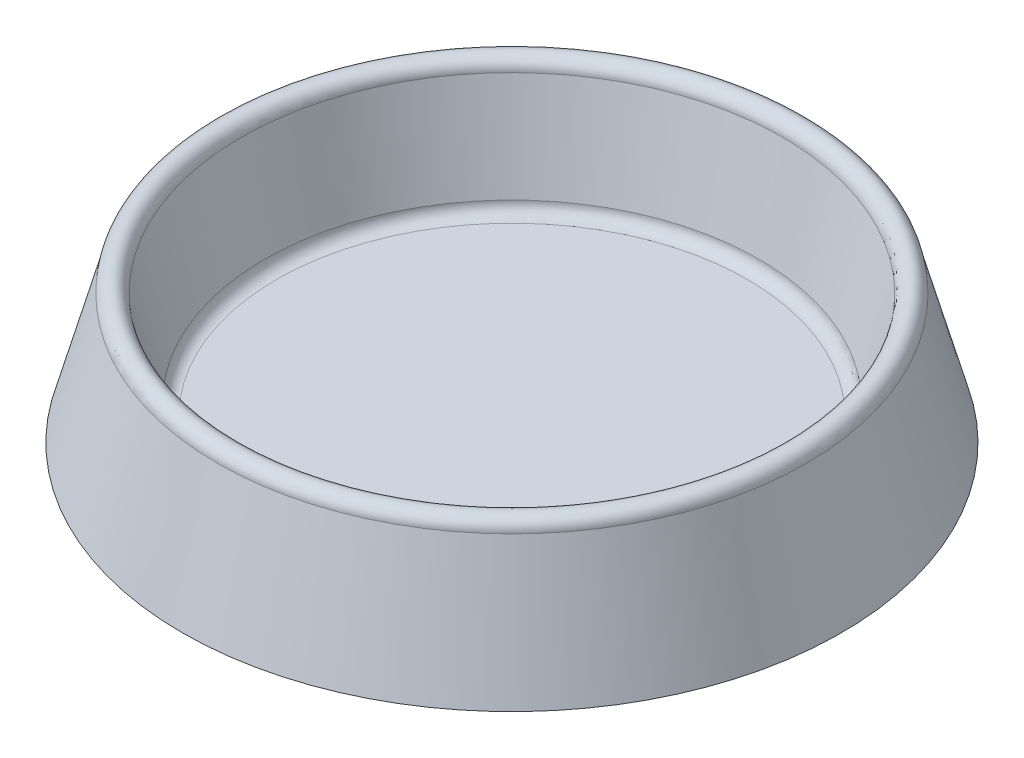
ISO-10303-21;
HEADER;
FILE_DESCRIPTION(('STEP AP214'),'2;1');
FILE_NAME('part.step','',(''),(''),'','','');
FILE_SCHEMA(('AUTOMOTIVE_DESIGN { 1 0 10303 214 1 1 1 1 }'));
ENDSEC;
DATA;
#1=APPLICATION_CONTEXT('core data for automotive mechanical design processes');
#2=APPLICATION_PROTOCOL_DEFINITION('international standard','automotive_design',2000,#1);
#3=PRODUCT_CONTEXT('',#1,'mechanical');
#4=PRODUCT('Part','Part','',(#3));
#5=PRODUCT_RELATED_PRODUCT_CATEGORY('part','',(#4));
#6=PRODUCT_DEFINITION_FORMATION('','',#4);
#7=PRODUCT_DEFINITION_CONTEXT('part definition',#1,'design');
#8=PRODUCT_DEFINITION('design','',#6,#7);
#9=PRODUCT_DEFINITION_SHAPE('','',#8);
#10=(LENGTH_UNIT() NAMED_UNIT(*) SI_UNIT(.MILLI.,.METRE.));
#11=(NAMED_UNIT(*) PLANE_ANGLE_UNIT() SI_UNIT($,.RADIAN.));
#12=(NAMED_UNIT(*) SI_UNIT($,.STERADIAN.) SOLID_ANGLE_UNIT());
#13=UNCERTAINTY_MEASURE_WITH_UNIT(LENGTH_MEASURE(1.E-05),#10,'distance_accuracy_value','');
#14=(GEOMETRIC_REPRESENTATION_CONTEXT(3) GLOBAL_UNCERTAINTY_ASSIGNED_CONTEXT((#13)) GLOBAL_UNIT_ASSIGNED_CONTEXT((#10,
#11,#12)) REPRESENTATION_CONTEXT('',''));
#15=CARTESIAN_POINT('',(0.,0.,0.));
#16=DIRECTION('',(0.,0.,1.));
#17=DIRECTION('',(1.,0.,0.));
#18=AXIS2_PLACEMENT_3D('',#15,#16,#17);
#19=CARTESIAN_POINT('',(-50.,9.36893203883496,0.));
#20=DIRECTION('',(0.,1.,0.));
#21=DIRECTION('',(0.,0.,1.));
#22=AXIS2_PLACEMENT_3D('',#19,#20,#21);
#23=PLANE('',#22);
#24=CARTESIAN_POINT('',(0.,9.36893203883495,0.));
#25=DIRECTION('',(0.,1.,0.));
#26=DIRECTION('',(0.,0.,1.));
#27=AXIS2_PLACEMENT_3D('',#24,#25,#26);
#28=CIRCLE('',#27,50.);
#29=CARTESIAN_POINT('',(0.,9.36893203883495,50.));
#30=VERTEX_POINT('',#29);
#31=EDGE_CURVE('E10',#30,#30,#28,.T.);
#32=ORIENTED_EDGE('',*,*,#31,.T.);
#33=EDGE_LOOP('',(#32));
#34=FACE_BOUND('',#33,.T.);
#35=ADVANCED_FACE('F32',(#34),#23,.T.);
#36=CARTESIAN_POINT('',(0.,11.868932038835,0.));
#37=DIRECTION('',(0.,1.,0.));
#38=DIRECTION('',(0.,0.,1.));
#39=AXIS2_PLACEMENT_3D('',#36,#37,#38);
#40=TOROIDAL_SURFACE('',#39,50.,2.5);
#41=CARTESIAN_POINT('',(0.,11.868932038835,0.));
#42=DIRECTION('',(0.,1.,0.));
#43=DIRECTION('',(0.,0.,1.));
#44=AXIS2_PLACEMENT_3D('',#41,#42,#43);
#45=CIRCLE('',#44,52.5);
#46=CARTESIAN_POINT('',(0.,11.868932038835,52.5));
#47=VERTEX_POINT('',#46);
#48=EDGE_CURVE('E38',#47,#47,#45,.T.);
#49=ORIENTED_EDGE('',*,*,#48,.T.);
#50=EDGE_LOOP('',(#49));
#51=FACE_BOUND('',#50,.T.);
#52=ORIENTED_EDGE('',*,*,#31,.F.);
#53=EDGE_LOOP('',(#52));
#54=FACE_BOUND('',#53,.T.);
#55=ADVANCED_FACE('F67',(#51,#54),#40,.F.);
#56=CARTESIAN_POINT('',(0.,11.868932038835,0.));
#57=DIRECTION('',(0.,1.,0.));
#58=DIRECTION('',(0.,0.,1.));
#59=AXIS2_PLACEMENT_3D('',#56,#57,#58);
#60=CONICAL_SURFACE('',#59,52.5,0.246414618486826);
#61=CARTESIAN_POINT('',(0.,31.747572815534,0.));
#62=DIRECTION('',(0.,1.,0.));
#63=DIRECTION('',(0.,0.,1.));
#64=AXIS2_PLACEMENT_3D('',#61,#62,#63);
#65=CIRCLE('',#64,57.5);
#66=CARTESIAN_POINT('',(0.,31.747572815534,57.5));
#67=VERTEX_POINT('',#66);
#68=EDGE_CURVE('E42',#67,#67,#65,.T.);
#69=ORIENTED_EDGE('',*,*,#68,.T.);
#70=EDGE_LOOP('',(#69));
#71=FACE_BOUND('',#70,.T.);
#72=ORIENTED_EDGE('',*,*,#48,.F.);
#73=EDGE_LOOP('',(#72));
#74=FACE_BOUND('',#73,.T.);
#75=ADVANCED_FACE('F71',(#71,#74),#60,.F.);
#76=CARTESIAN_POINT('',(0.,31.747572815534,0.));
#77=DIRECTION('',(0.,1.,0.));
#78=DIRECTION('',(0.,0.,1.));
#79=AXIS2_PLACEMENT_3D('',#76,#77,#78);
#80=TOROIDAL_SURFACE('',#79,60.,2.5);
#81=CARTESIAN_POINT('',(0.,31.747572815534,0.));
#82=DIRECTION('',(0.,1.,0.));
#83=DIRECTION('',(0.,0.,1.));
#84=AXIS2_PLACEMENT_3D('',#81,#82,#83);
#85=CIRCLE('',#84,62.5);
#86=CARTESIAN_POINT('',(0.,31.747572815534,62.5));
#87=VERTEX_POINT('',#86);
#88=EDGE_CURVE('E46',#87,#87,#85,.T.);
#89=ORIENTED_EDGE('',*,*,#88,.T.);
#90=EDGE_LOOP('',(#89));
#91=FACE_BOUND('',#90,.T.);
#92=ORIENTED_EDGE('',*,*,#68,.F.);
#93=EDGE_LOOP('',(#92));
#94=FACE_BOUND('',#93,.T.);
#95=ADVANCED_FACE('F64',(#91,#94),#80,.T.);
#96=CARTESIAN_POINT('',(0.,31.747572815534,0.));
#97=DIRECTION('',(0.,-1.,0.));
#98=DIRECTION('',(0.,0.,-1.));
#99=AXIS2_PLACEMENT_3D('',#96,#97,#98);
#100=CONICAL_SURFACE('',#99,62.5,0.267376908069071);
#101=CARTESIAN_POINT('',(0.,4.36893203883495,0.));
#102=DIRECTION('',(0.,1.,0.));
#103=DIRECTION('',(0.,0.,1.));
#104=AXIS2_PLACEMENT_3D('',#101,#102,#103);
#105=CIRCLE('',#104,70.);
#106=CARTESIAN_POINT('',(0.,4.36893203883495,70.));
#107=VERTEX_POINT('',#106);
#108=EDGE_CURVE('E51',#107,#107,#105,.T.);
#109=ORIENTED_EDGE('',*,*,#108,.T.);
#110=EDGE_LOOP('',(#109));
#111=FACE_BOUND('',#110,.T.);
#112=ORIENTED_EDGE('',*,*,#88,.F.);
#113=EDGE_LOOP('',(#112));
#114=FACE_BOUND('',#113,.T.);
#115=ADVANCED_FACE('F55',(#111,#114),#100,.T.);
#116=CARTESIAN_POINT('',(-70.,4.36893203883495,0.));
#117=DIRECTION('',(0.,-1.,0.));
#118=DIRECTION('',(0.,0.,-1.));
#119=AXIS2_PLACEMENT_3D('',#116,#117,#118);
#120=PLANE('',#119);
#121=ORIENTED_EDGE('',*,*,#108,.F.);
#122=EDGE_LOOP('',(#121));
#123=FACE_BOUND('',#122,.T.);
#124=ADVANCED_FACE('F58',(#123),#120,.T.);
#125=CLOSED_SHELL('',(#35,#55,#75,#95,#115,#124));
#126=MANIFOLD_SOLID_BREP('B2',#125);
#127=ADVANCED_BREP_SHAPE_REPRESENTATION('',(#18,#126),#14);
#128=SHAPE_DEFINITION_REPRESENTATION(#9,#127);
ENDSEC;
END-ISO-10303-21;
